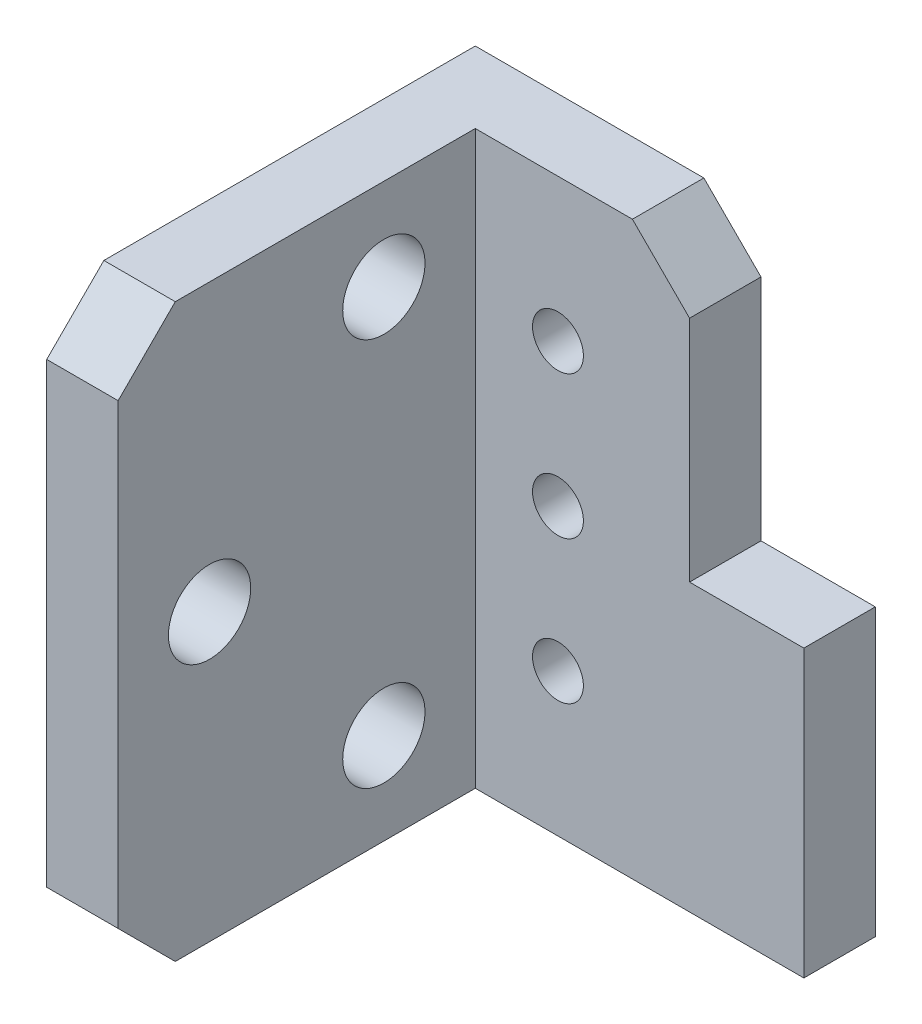
ISO-10303-21;
HEADER;
FILE_DESCRIPTION(('STEP AP214'),'2;1');
FILE_NAME('part.step','',(''),(''),'','','');
FILE_SCHEMA(('AUTOMOTIVE_DESIGN { 1 0 10303 214 1 1 1 1 }'));
ENDSEC;
DATA;
#1=APPLICATION_CONTEXT('core data for automotive mechanical design processes');
#2=APPLICATION_PROTOCOL_DEFINITION('international standard','automotive_design',2000,#1);
#3=PRODUCT_CONTEXT('',#1,'mechanical');
#4=PRODUCT('Part','Part','',(#3));
#5=PRODUCT_RELATED_PRODUCT_CATEGORY('part','',(#4));
#6=PRODUCT_DEFINITION_FORMATION('','',#4);
#7=PRODUCT_DEFINITION_CONTEXT('part definition',#1,'design');
#8=PRODUCT_DEFINITION('design','',#6,#7);
#9=PRODUCT_DEFINITION_SHAPE('','',#8);
#10=(LENGTH_UNIT() NAMED_UNIT(*) SI_UNIT(.MILLI.,.METRE.));
#11=(NAMED_UNIT(*) PLANE_ANGLE_UNIT() SI_UNIT($,.RADIAN.));
#12=(NAMED_UNIT(*) SI_UNIT($,.STERADIAN.) SOLID_ANGLE_UNIT());
#13=UNCERTAINTY_MEASURE_WITH_UNIT(LENGTH_MEASURE(1.E-05),#10,'distance_accuracy_value','');
#14=(GEOMETRIC_REPRESENTATION_CONTEXT(3) GLOBAL_UNCERTAINTY_ASSIGNED_CONTEXT((#13)) GLOBAL_UNIT_ASSIGNED_CONTEXT((#10,
#11,#12)) REPRESENTATION_CONTEXT('',''));
#15=CARTESIAN_POINT('',(0.,0.,0.));
#16=DIRECTION('',(0.,0.,1.));
#17=DIRECTION('',(1.,0.,0.));
#18=AXIS2_PLACEMENT_3D('',#15,#16,#17);
#19=CARTESIAN_POINT('',(0.,25.4,0.));
#20=DIRECTION('',(1.,0.,0.));
#21=DIRECTION('',(0.,0.,-1.));
#22=AXIS2_PLACEMENT_3D('',#19,#20,#21);
#23=PLANE('',#22);
#24=CARTESIAN_POINT('',(0.,4.064,7.239));
#25=DIRECTION('',(-1.,0.,0.));
#26=DIRECTION('',(0.,0.,1.));
#27=AXIS2_PLACEMENT_3D('',#24,#25,#26);
#28=CIRCLE('',#27,1.8288);
#29=CARTESIAN_POINT('',(0.,4.064,9.0678));
#30=VERTEX_POINT('',#29);
#31=EDGE_CURVE('E170',#30,#30,#28,.T.);
#32=ORIENTED_EDGE('',*,*,#31,.F.);
#33=EDGE_LOOP('',(#32));
#34=FACE_BOUND('',#33,.T.);
#35=CARTESIAN_POINT('',(0.,21.336,7.239));
#36=DIRECTION('',(-1.,0.,0.));
#37=DIRECTION('',(0.,0.,1.));
#38=AXIS2_PLACEMENT_3D('',#35,#36,#37);
#39=CIRCLE('',#38,1.8288);
#40=CARTESIAN_POINT('',(0.,21.336,9.0678));
#41=VERTEX_POINT('',#40);
#42=EDGE_CURVE('E174',#41,#41,#39,.T.);
#43=ORIENTED_EDGE('',*,*,#42,.F.);
#44=EDGE_LOOP('',(#43));
#45=FACE_BOUND('',#44,.T.);
#46=CARTESIAN_POINT('',(0.,12.7,14.986));
#47=DIRECTION('',(-1.,0.,0.));
#48=DIRECTION('',(0.,0.,1.));
#49=AXIS2_PLACEMENT_3D('',#46,#47,#48);
#50=CIRCLE('',#49,1.8288);
#51=CARTESIAN_POINT('',(0.,12.7,16.8148));
#52=VERTEX_POINT('',#51);
#53=EDGE_CURVE('E178',#52,#52,#50,.T.);
#54=ORIENTED_EDGE('',*,*,#53,.F.);
#55=EDGE_LOOP('',(#54));
#56=FACE_BOUND('',#55,.T.);
#57=DIRECTION('',(0.,0.,1.));
#58=VECTOR('',#57,1.);
#59=CARTESIAN_POINT('',(0.,0.,0.));
#60=LINE('',#59,#58);
#61=CARTESIAN_POINT('',(0.,0.,0.));
#62=VERTEX_POINT('',#61);
#63=CARTESIAN_POINT('',(0.,0.,16.51));
#64=VERTEX_POINT('',#63);
#65=EDGE_CURVE('E124',#62,#64,#60,.T.);
#66=ORIENTED_EDGE('',*,*,#65,.T.);
#67=DIRECTION('',(0.,-0.707106781186546,-0.707106781186549));
#68=VECTOR('',#67,1.);
#69=CARTESIAN_POINT('',(0.,2.54,19.05));
#70=LINE('',#69,#68);
#71=CARTESIAN_POINT('',(0.,2.54,19.05));
#72=VERTEX_POINT('',#71);
#73=EDGE_CURVE('E11',#64,#72,#70,.F.);
#74=ORIENTED_EDGE('',*,*,#73,.T.);
#75=DIRECTION('',(0.,-1.,0.));
#76=VECTOR('',#75,1.);
#77=CARTESIAN_POINT('',(0.,25.4,19.05));
#78=LINE('',#77,#76);
#79=CARTESIAN_POINT('',(0.,22.86,19.05));
#80=VERTEX_POINT('',#79);
#81=EDGE_CURVE('E210',#80,#72,#78,.T.);
#82=ORIENTED_EDGE('',*,*,#81,.F.);
#83=DIRECTION('',(0.,0.707106781186549,-0.707106781186546));
#84=VECTOR('',#83,1.);
#85=CARTESIAN_POINT('',(0.,25.4,16.51));
#86=LINE('',#85,#84);
#87=CARTESIAN_POINT('',(0.,25.4,16.51));
#88=VERTEX_POINT('',#87);
#89=EDGE_CURVE('E44',#80,#88,#86,.T.);
#90=ORIENTED_EDGE('',*,*,#89,.T.);
#91=DIRECTION('',(0.,0.,1.));
#92=VECTOR('',#91,1.);
#93=CARTESIAN_POINT('',(0.,25.4,0.));
#94=LINE('',#93,#92);
#95=CARTESIAN_POINT('',(0.,25.4,0.));
#96=VERTEX_POINT('',#95);
#97=EDGE_CURVE('E129',#96,#88,#94,.T.);
#98=ORIENTED_EDGE('',*,*,#97,.F.);
#99=DIRECTION('',(0.,-1.,0.));
#100=VECTOR('',#99,1.);
#101=CARTESIAN_POINT('',(0.,25.4,0.));
#102=LINE('',#101,#100);
#103=EDGE_CURVE('E193',#96,#62,#102,.T.);
#104=ORIENTED_EDGE('',*,*,#103,.T.);
#105=EDGE_LOOP('',(#66,#74,#82,#90,#98,#104));
#106=FACE_BOUND('',#105,.T.);
#107=ADVANCED_FACE('F35',(#34,#45,#56,#106),#23,.F.);
#108=CARTESIAN_POINT('',(0.,25.4,19.05));
#109=DIRECTION('',(0.,0.,-1.));
#110=DIRECTION('',(-1.,0.,0.));
#111=AXIS2_PLACEMENT_3D('',#108,#109,#110);
#112=PLANE('',#111);
#113=ORIENTED_EDGE('',*,*,#81,.T.);
#114=DIRECTION('',(1.,0.,0.));
#115=VECTOR('',#114,1.);
#116=CARTESIAN_POINT('',(0.,2.54,19.05));
#117=LINE('',#116,#115);
#118=CARTESIAN_POINT('',(3.175,2.54,19.05));
#119=VERTEX_POINT('',#118);
#120=EDGE_CURVE('E231',#72,#119,#117,.T.);
#121=ORIENTED_EDGE('',*,*,#120,.T.);
#122=DIRECTION('',(0.,-1.,0.));
#123=VECTOR('',#122,1.);
#124=CARTESIAN_POINT('',(3.175,25.4,19.05));
#125=LINE('',#124,#123);
#126=CARTESIAN_POINT('',(3.175,22.86,19.05));
#127=VERTEX_POINT('',#126);
#128=EDGE_CURVE('E207',#127,#119,#125,.T.);
#129=ORIENTED_EDGE('',*,*,#128,.F.);
#130=DIRECTION('',(-1.,0.,0.));
#131=VECTOR('',#130,1.);
#132=CARTESIAN_POINT('',(0.,22.86,19.05));
#133=LINE('',#132,#131);
#134=EDGE_CURVE('E56',#127,#80,#133,.T.);
#135=ORIENTED_EDGE('',*,*,#134,.T.);
#136=EDGE_LOOP('',(#113,#121,#129,#135));
#137=FACE_BOUND('',#136,.T.);
#138=ADVANCED_FACE('F249',(#137),#112,.F.);
#139=CARTESIAN_POINT('',(3.175,25.4,19.05));
#140=DIRECTION('',(-1.,0.,0.));
#141=DIRECTION('',(0.,0.,1.));
#142=AXIS2_PLACEMENT_3D('',#139,#140,#141);
#143=PLANE('',#142);
#144=CARTESIAN_POINT('',(3.175,4.064,7.239));
#145=DIRECTION('',(-1.,0.,0.));
#146=DIRECTION('',(0.,0.,1.));
#147=AXIS2_PLACEMENT_3D('',#144,#145,#146);
#148=CIRCLE('',#147,1.8288);
#149=CARTESIAN_POINT('',(3.175,4.064,9.0678));
#150=VERTEX_POINT('',#149);
#151=EDGE_CURVE('E173',#150,#150,#148,.T.);
#152=ORIENTED_EDGE('',*,*,#151,.T.);
#153=EDGE_LOOP('',(#152));
#154=FACE_BOUND('',#153,.T.);
#155=CARTESIAN_POINT('',(3.175,21.336,7.239));
#156=DIRECTION('',(-1.,0.,0.));
#157=DIRECTION('',(0.,0.,1.));
#158=AXIS2_PLACEMENT_3D('',#155,#156,#157);
#159=CIRCLE('',#158,1.8288);
#160=CARTESIAN_POINT('',(3.175,21.336,9.0678));
#161=VERTEX_POINT('',#160);
#162=EDGE_CURVE('E177',#161,#161,#159,.T.);
#163=ORIENTED_EDGE('',*,*,#162,.T.);
#164=EDGE_LOOP('',(#163));
#165=FACE_BOUND('',#164,.T.);
#166=CARTESIAN_POINT('',(3.175,12.7,14.986));
#167=DIRECTION('',(-1.,0.,0.));
#168=DIRECTION('',(0.,0.,1.));
#169=AXIS2_PLACEMENT_3D('',#166,#167,#168);
#170=CIRCLE('',#169,1.8288);
#171=CARTESIAN_POINT('',(3.175,12.7,16.8148));
#172=VERTEX_POINT('',#171);
#173=EDGE_CURVE('E181',#172,#172,#170,.T.);
#174=ORIENTED_EDGE('',*,*,#173,.T.);
#175=EDGE_LOOP('',(#174));
#176=FACE_BOUND('',#175,.T.);
#177=ORIENTED_EDGE('',*,*,#128,.T.);
#178=DIRECTION('',(0.,0.707106781186546,0.707106781186549));
#179=VECTOR('',#178,1.);
#180=CARTESIAN_POINT('',(3.175,2.54,19.05));
#181=LINE('',#180,#179);
#182=CARTESIAN_POINT('',(3.175,0.,16.51));
#183=VERTEX_POINT('',#182);
#184=EDGE_CURVE('E236',#119,#183,#181,.F.);
#185=ORIENTED_EDGE('',*,*,#184,.T.);
#186=DIRECTION('',(0.,0.,-1.));
#187=VECTOR('',#186,1.);
#188=CARTESIAN_POINT('',(3.175,0.,19.05));
#189=LINE('',#188,#187);
#190=CARTESIAN_POINT('',(3.175,0.,3.175));
#191=VERTEX_POINT('',#190);
#192=EDGE_CURVE('E195',#183,#191,#189,.T.);
#193=ORIENTED_EDGE('',*,*,#192,.T.);
#194=DIRECTION('',(0.,-1.,0.));
#195=VECTOR('',#194,1.);
#196=CARTESIAN_POINT('',(3.175,25.4,3.175));
#197=LINE('',#196,#195);
#198=CARTESIAN_POINT('',(3.175,25.4,3.175));
#199=VERTEX_POINT('',#198);
#200=EDGE_CURVE('E204',#199,#191,#197,.T.);
#201=ORIENTED_EDGE('',*,*,#200,.F.);
#202=DIRECTION('',(0.,0.,-1.));
#203=VECTOR('',#202,1.);
#204=CARTESIAN_POINT('',(3.175,25.4,19.05));
#205=LINE('',#204,#203);
#206=CARTESIAN_POINT('',(3.175,25.4,16.51));
#207=VERTEX_POINT('',#206);
#208=EDGE_CURVE('E186',#207,#199,#205,.T.);
#209=ORIENTED_EDGE('',*,*,#208,.F.);
#210=DIRECTION('',(0.,-0.707106781186549,0.707106781186546));
#211=VECTOR('',#210,1.);
#212=CARTESIAN_POINT('',(3.175,25.4,16.51));
#213=LINE('',#212,#211);
#214=EDGE_CURVE('E234',#207,#127,#213,.T.);
#215=ORIENTED_EDGE('',*,*,#214,.T.);
#216=EDGE_LOOP('',(#177,#185,#193,#201,#209,#215));
#217=FACE_BOUND('',#216,.T.);
#218=ADVANCED_FACE('F247',(#154,#165,#176,#217),#143,.F.);
#219=CARTESIAN_POINT('',(12.7,25.4,3.175));
#220=DIRECTION('',(0.,0.,-1.));
#221=DIRECTION('',(-1.,0.,0.));
#222=AXIS2_PLACEMENT_3D('',#219,#220,#221);
#223=PLANE('',#222);
#224=DIRECTION('',(-1.,0.,0.));
#225=VECTOR('',#224,1.);
#226=CARTESIAN_POINT('',(17.78,12.7,3.175));
#227=LINE('',#226,#225);
#228=CARTESIAN_POINT('',(17.78,12.7,3.175));
#229=VERTEX_POINT('',#228);
#230=CARTESIAN_POINT('',(12.7,12.7,3.175));
#231=VERTEX_POINT('',#230);
#232=EDGE_CURVE('E150',#229,#231,#227,.T.);
#233=ORIENTED_EDGE('',*,*,#232,.T.);
#234=DIRECTION('',(0.,-1.,0.));
#235=VECTOR('',#234,1.);
#236=CARTESIAN_POINT('',(12.7,25.4,3.175));
#237=LINE('',#236,#235);
#238=CARTESIAN_POINT('',(12.7,22.86,3.175));
#239=VERTEX_POINT('',#238);
#240=EDGE_CURVE('E201',#239,#231,#237,.T.);
#241=ORIENTED_EDGE('',*,*,#240,.F.);
#242=DIRECTION('',(-0.707106781186547,0.707106781186548,0.));
#243=VECTOR('',#242,1.);
#244=CARTESIAN_POINT('',(10.16,25.4,3.175));
#245=LINE('',#244,#243);
#246=CARTESIAN_POINT('',(10.16,25.4,3.175));
#247=VERTEX_POINT('',#246);
#248=EDGE_CURVE('E222',#239,#247,#245,.T.);
#249=ORIENTED_EDGE('',*,*,#248,.T.);
#250=DIRECTION('',(1.,0.,0.));
#251=VECTOR('',#250,1.);
#252=CARTESIAN_POINT('',(12.7,25.4,3.175));
#253=LINE('',#252,#251);
#254=EDGE_CURVE('E188',#199,#247,#253,.T.);
#255=ORIENTED_EDGE('',*,*,#254,.F.);
#256=ORIENTED_EDGE('',*,*,#200,.T.);
#257=DIRECTION('',(1.,0.,0.));
#258=VECTOR('',#257,1.);
#259=CARTESIAN_POINT('',(12.7,0.,3.175));
#260=LINE('',#259,#258);
#261=CARTESIAN_POINT('',(17.78,0.,3.175));
#262=VERTEX_POINT('',#261);
#263=EDGE_CURVE('E130',#191,#262,#260,.T.);
#264=ORIENTED_EDGE('',*,*,#263,.T.);
#265=DIRECTION('',(0.,1.,0.));
#266=VECTOR('',#265,1.);
#267=CARTESIAN_POINT('',(17.78,12.7,3.175));
#268=LINE('',#267,#266);
#269=EDGE_CURVE('E138',#262,#229,#268,.T.);
#270=ORIENTED_EDGE('',*,*,#269,.T.);
#271=EDGE_LOOP('',(#233,#241,#249,#255,#256,#264,#270));
#272=FACE_BOUND('',#271,.T.);
#273=CARTESIAN_POINT('',(6.84999439999996,6.35,3.175));
#274=DIRECTION('',(0.,0.,-1.));
#275=DIRECTION('',(-1.,0.,0.));
#276=AXIS2_PLACEMENT_3D('',#273,#274,#275);
#277=CIRCLE('',#276,1.13029999999999);
#278=CARTESIAN_POINT('',(5.71969439999997,6.35,3.175));
#279=VERTEX_POINT('',#278);
#280=EDGE_CURVE('E158',#279,#279,#277,.T.);
#281=ORIENTED_EDGE('',*,*,#280,.T.);
#282=EDGE_LOOP('',(#281));
#283=FACE_BOUND('',#282,.T.);
#284=CARTESIAN_POINT('',(6.84999439999996,12.7,3.175));
#285=DIRECTION('',(0.,0.,-1.));
#286=DIRECTION('',(-1.,0.,0.));
#287=AXIS2_PLACEMENT_3D('',#284,#285,#286);
#288=CIRCLE('',#287,1.13029999999999);
#289=CARTESIAN_POINT('',(5.71969439999997,12.7,3.175));
#290=VERTEX_POINT('',#289);
#291=EDGE_CURVE('E39',#290,#290,#288,.T.);
#292=ORIENTED_EDGE('',*,*,#291,.T.);
#293=EDGE_LOOP('',(#292));
#294=FACE_BOUND('',#293,.T.);
#295=CARTESIAN_POINT('',(6.84999439999996,19.05,3.175));
#296=DIRECTION('',(0.,0.,-1.));
#297=DIRECTION('',(-1.,0.,0.));
#298=AXIS2_PLACEMENT_3D('',#295,#296,#297);
#299=CIRCLE('',#298,1.13029999999999);
#300=CARTESIAN_POINT('',(5.71969439999997,19.05,3.175));
#301=VERTEX_POINT('',#300);
#302=EDGE_CURVE('E167',#301,#301,#299,.T.);
#303=ORIENTED_EDGE('',*,*,#302,.T.);
#304=EDGE_LOOP('',(#303));
#305=FACE_BOUND('',#304,.T.);
#306=ADVANCED_FACE('F257',(#272,#283,#294,#305),#223,.F.);
#307=CARTESIAN_POINT('',(12.7,25.4,0.));
#308=DIRECTION('',(-1.,0.,0.));
#309=DIRECTION('',(0.,0.,1.));
#310=AXIS2_PLACEMENT_3D('',#307,#308,#309);
#311=PLANE('',#310);
#312=ORIENTED_EDGE('',*,*,#240,.T.);
#313=DIRECTION('',(0.,0.,-1.));
#314=VECTOR('',#313,1.);
#315=CARTESIAN_POINT('',(12.7,12.7,0.));
#316=LINE('',#315,#314);
#317=CARTESIAN_POINT('',(12.7,12.7,0.));
#318=VERTEX_POINT('',#317);
#319=EDGE_CURVE('E152',#231,#318,#316,.T.);
#320=ORIENTED_EDGE('',*,*,#319,.T.);
#321=DIRECTION('',(0.,-1.,0.));
#322=VECTOR('',#321,1.);
#323=CARTESIAN_POINT('',(12.7,25.4,0.));
#324=LINE('',#323,#322);
#325=CARTESIAN_POINT('',(12.7,22.86,0.));
#326=VERTEX_POINT('',#325);
#327=EDGE_CURVE('E199',#326,#318,#324,.T.);
#328=ORIENTED_EDGE('',*,*,#327,.F.);
#329=DIRECTION('',(0.,0.,1.));
#330=VECTOR('',#329,1.);
#331=CARTESIAN_POINT('',(12.7,22.86,3.175));
#332=LINE('',#331,#330);
#333=EDGE_CURVE('E212',#326,#239,#332,.T.);
#334=ORIENTED_EDGE('',*,*,#333,.T.);
#335=EDGE_LOOP('',(#312,#320,#328,#334));
#336=FACE_BOUND('',#335,.T.);
#337=ADVANCED_FACE('F269',(#336),#311,.F.);
#338=CARTESIAN_POINT('',(0.,25.4,0.));
#339=DIRECTION('',(0.,0.,1.));
#340=DIRECTION('',(1.,0.,0.));
#341=AXIS2_PLACEMENT_3D('',#338,#339,#340);
#342=PLANE('',#341);
#343=CARTESIAN_POINT('',(6.84999439999996,6.35,0.));
#344=DIRECTION('',(0.,0.,-1.));
#345=DIRECTION('',(-1.,0.,0.));
#346=AXIS2_PLACEMENT_3D('',#343,#344,#345);
#347=CIRCLE('',#346,1.13029999999999);
#348=CARTESIAN_POINT('',(5.71969439999997,6.35,0.));
#349=VERTEX_POINT('',#348);
#350=EDGE_CURVE('E155',#349,#349,#347,.T.);
#351=ORIENTED_EDGE('',*,*,#350,.F.);
#352=EDGE_LOOP('',(#351));
#353=FACE_BOUND('',#352,.T.);
#354=CARTESIAN_POINT('',(6.84999439999996,12.7,0.));
#355=DIRECTION('',(0.,0.,-1.));
#356=DIRECTION('',(-1.,0.,0.));
#357=AXIS2_PLACEMENT_3D('',#354,#355,#356);
#358=CIRCLE('',#357,1.13029999999999);
#359=CARTESIAN_POINT('',(5.71969439999997,12.7,0.));
#360=VERTEX_POINT('',#359);
#361=EDGE_CURVE('E161',#360,#360,#358,.T.);
#362=ORIENTED_EDGE('',*,*,#361,.F.);
#363=EDGE_LOOP('',(#362));
#364=FACE_BOUND('',#363,.T.);
#365=CARTESIAN_POINT('',(6.84999439999996,19.05,0.));
#366=DIRECTION('',(0.,0.,-1.));
#367=DIRECTION('',(-1.,0.,0.));
#368=AXIS2_PLACEMENT_3D('',#365,#366,#367);
#369=CIRCLE('',#368,1.13029999999999);
#370=CARTESIAN_POINT('',(5.71969439999997,19.05,0.));
#371=VERTEX_POINT('',#370);
#372=EDGE_CURVE('E164',#371,#371,#369,.T.);
#373=ORIENTED_EDGE('',*,*,#372,.F.);
#374=EDGE_LOOP('',(#373));
#375=FACE_BOUND('',#374,.T.);
#376=ORIENTED_EDGE('',*,*,#327,.T.);
#377=DIRECTION('',(1.,0.,0.));
#378=VECTOR('',#377,1.);
#379=CARTESIAN_POINT('',(17.78,12.7,0.));
#380=LINE('',#379,#378);
#381=CARTESIAN_POINT('',(17.78,12.7,0.));
#382=VERTEX_POINT('',#381);
#383=EDGE_CURVE('E140',#318,#382,#380,.T.);
#384=ORIENTED_EDGE('',*,*,#383,.T.);
#385=DIRECTION('',(0.,-1.,0.));
#386=VECTOR('',#385,1.);
#387=CARTESIAN_POINT('',(17.78,12.7,0.));
#388=LINE('',#387,#386);
#389=CARTESIAN_POINT('',(17.78,0.,0.));
#390=VERTEX_POINT('',#389);
#391=EDGE_CURVE('E137',#382,#390,#388,.T.);
#392=ORIENTED_EDGE('',*,*,#391,.T.);
#393=DIRECTION('',(-1.,0.,0.));
#394=VECTOR('',#393,1.);
#395=CARTESIAN_POINT('',(0.,0.,0.));
#396=LINE('',#395,#394);
#397=EDGE_CURVE('E119',#390,#62,#396,.T.);
#398=ORIENTED_EDGE('',*,*,#397,.T.);
#399=ORIENTED_EDGE('',*,*,#103,.F.);
#400=DIRECTION('',(-1.,0.,0.));
#401=VECTOR('',#400,1.);
#402=CARTESIAN_POINT('',(0.,25.4,0.));
#403=LINE('',#402,#401);
#404=CARTESIAN_POINT('',(10.16,25.4,0.));
#405=VERTEX_POINT('',#404);
#406=EDGE_CURVE('E191',#405,#96,#403,.T.);
#407=ORIENTED_EDGE('',*,*,#406,.F.);
#408=DIRECTION('',(0.707106781186547,-0.707106781186548,0.));
#409=VECTOR('',#408,1.);
#410=CARTESIAN_POINT('',(10.16,25.4,0.));
#411=LINE('',#410,#409);
#412=EDGE_CURVE('E218',#405,#326,#411,.T.);
#413=ORIENTED_EDGE('',*,*,#412,.T.);
#414=EDGE_LOOP('',(#376,#384,#392,#398,#399,#407,#413));
#415=FACE_BOUND('',#414,.T.);
#416=ADVANCED_FACE('F143',(#353,#364,#375,#415),#342,.F.);
#417=CARTESIAN_POINT('',(0.,25.4,0.));
#418=DIRECTION('',(0.,1.,0.));
#419=DIRECTION('',(0.,0.,1.));
#420=AXIS2_PLACEMENT_3D('',#417,#418,#419);
#421=PLANE('',#420);
#422=ORIENTED_EDGE('',*,*,#254,.T.);
#423=DIRECTION('',(0.,0.,-1.));
#424=VECTOR('',#423,1.);
#425=CARTESIAN_POINT('',(10.16,25.4,0.));
#426=LINE('',#425,#424);
#427=EDGE_CURVE('E227',#247,#405,#426,.T.);
#428=ORIENTED_EDGE('',*,*,#427,.T.);
#429=ORIENTED_EDGE('',*,*,#406,.T.);
#430=ORIENTED_EDGE('',*,*,#97,.T.);
#431=DIRECTION('',(1.,0.,0.));
#432=VECTOR('',#431,1.);
#433=CARTESIAN_POINT('',(3.175,25.4,16.51));
#434=LINE('',#433,#432);
#435=EDGE_CURVE('E224',#88,#207,#434,.T.);
#436=ORIENTED_EDGE('',*,*,#435,.T.);
#437=ORIENTED_EDGE('',*,*,#208,.T.);
#438=EDGE_LOOP('',(#422,#428,#429,#430,#436,#437));
#439=FACE_BOUND('',#438,.T.);
#440=ADVANCED_FACE('F243',(#439),#421,.T.);
#441=CARTESIAN_POINT('',(0.,0.,0.));
#442=DIRECTION('',(0.,1.,0.));
#443=DIRECTION('',(0.,0.,1.));
#444=AXIS2_PLACEMENT_3D('',#441,#442,#443);
#445=PLANE('',#444);
#446=ORIENTED_EDGE('',*,*,#397,.F.);
#447=DIRECTION('',(0.,0.,-1.));
#448=VECTOR('',#447,1.);
#449=CARTESIAN_POINT('',(17.78,0.,17.9856178129071));
#450=LINE('',#449,#448);
#451=EDGE_CURVE('E123',#262,#390,#450,.T.);
#452=ORIENTED_EDGE('',*,*,#451,.F.);
#453=ORIENTED_EDGE('',*,*,#263,.F.);
#454=ORIENTED_EDGE('',*,*,#192,.F.);
#455=DIRECTION('',(-1.,0.,0.));
#456=VECTOR('',#455,1.);
#457=CARTESIAN_POINT('',(0.,0.,16.51));
#458=LINE('',#457,#456);
#459=EDGE_CURVE('E220',#183,#64,#458,.T.);
#460=ORIENTED_EDGE('',*,*,#459,.T.);
#461=ORIENTED_EDGE('',*,*,#65,.F.);
#462=EDGE_LOOP('',(#446,#452,#453,#454,#460,#461));
#463=FACE_BOUND('',#462,.T.);
#464=ADVANCED_FACE('F121',(#463),#445,.F.);
#465=CARTESIAN_POINT('',(0.,12.7,14.986));
#466=DIRECTION('',(-1.,0.,0.));
#467=DIRECTION('',(0.,0.,1.));
#468=AXIS2_PLACEMENT_3D('',#465,#466,#467);
#469=CYLINDRICAL_SURFACE('',#468,1.8288);
#470=ORIENTED_EDGE('',*,*,#53,.T.);
#471=EDGE_LOOP('',(#470));
#472=FACE_BOUND('',#471,.T.);
#473=ORIENTED_EDGE('',*,*,#173,.F.);
#474=EDGE_LOOP('',(#473));
#475=FACE_BOUND('',#474,.T.);
#476=ADVANCED_FACE('F319',(#472,#475),#469,.F.);
#477=CARTESIAN_POINT('',(0.,21.336,7.239));
#478=DIRECTION('',(-1.,0.,0.));
#479=DIRECTION('',(0.,0.,1.));
#480=AXIS2_PLACEMENT_3D('',#477,#478,#479);
#481=CYLINDRICAL_SURFACE('',#480,1.8288);
#482=ORIENTED_EDGE('',*,*,#42,.T.);
#483=EDGE_LOOP('',(#482));
#484=FACE_BOUND('',#483,.T.);
#485=ORIENTED_EDGE('',*,*,#162,.F.);
#486=EDGE_LOOP('',(#485));
#487=FACE_BOUND('',#486,.T.);
#488=ADVANCED_FACE('F315',(#484,#487),#481,.F.);
#489=CARTESIAN_POINT('',(0.,4.064,7.239));
#490=DIRECTION('',(-1.,0.,0.));
#491=DIRECTION('',(0.,0.,1.));
#492=AXIS2_PLACEMENT_3D('',#489,#490,#491);
#493=CYLINDRICAL_SURFACE('',#492,1.8288);
#494=ORIENTED_EDGE('',*,*,#31,.T.);
#495=EDGE_LOOP('',(#494));
#496=FACE_BOUND('',#495,.T.);
#497=ORIENTED_EDGE('',*,*,#151,.F.);
#498=EDGE_LOOP('',(#497));
#499=FACE_BOUND('',#498,.T.);
#500=ADVANCED_FACE('F295',(#496,#499),#493,.F.);
#501=CARTESIAN_POINT('',(10.16,25.4,0.));
#502=DIRECTION('',(0.707106781186548,0.707106781186547,0.));
#503=DIRECTION('',(0.,0.,1.));
#504=AXIS2_PLACEMENT_3D('',#501,#502,#503);
#505=PLANE('',#504);
#506=ORIENTED_EDGE('',*,*,#248,.F.);
#507=ORIENTED_EDGE('',*,*,#333,.F.);
#508=ORIENTED_EDGE('',*,*,#412,.F.);
#509=ORIENTED_EDGE('',*,*,#427,.F.);
#510=EDGE_LOOP('',(#506,#507,#508,#509));
#511=FACE_BOUND('',#510,.T.);
#512=ADVANCED_FACE('F265',(#511),#505,.T.);
#513=CARTESIAN_POINT('',(0.,2.54,19.05));
#514=DIRECTION('',(0.,0.707106781186549,-0.707106781186546));
#515=DIRECTION('',(1.,0.,0.));
#516=AXIS2_PLACEMENT_3D('',#513,#514,#515);
#517=PLANE('',#516);
#518=ORIENTED_EDGE('',*,*,#73,.F.);
#519=ORIENTED_EDGE('',*,*,#459,.F.);
#520=ORIENTED_EDGE('',*,*,#184,.F.);
#521=ORIENTED_EDGE('',*,*,#120,.F.);
#522=EDGE_LOOP('',(#518,#519,#520,#521));
#523=FACE_BOUND('',#522,.T.);
#524=ADVANCED_FACE('F252',(#523),#517,.F.);
#525=CARTESIAN_POINT('',(0.,25.4,16.51));
#526=DIRECTION('',(0.,0.707106781186546,0.707106781186549));
#527=DIRECTION('',(-1.,0.,0.));
#528=AXIS2_PLACEMENT_3D('',#525,#526,#527);
#529=PLANE('',#528);
#530=ORIENTED_EDGE('',*,*,#89,.F.);
#531=ORIENTED_EDGE('',*,*,#134,.F.);
#532=ORIENTED_EDGE('',*,*,#214,.F.);
#533=ORIENTED_EDGE('',*,*,#435,.F.);
#534=EDGE_LOOP('',(#530,#531,#532,#533));
#535=FACE_BOUND('',#534,.T.);
#536=ADVANCED_FACE('F37',(#535),#529,.T.);
#537=CARTESIAN_POINT('',(6.84999439999996,19.05,0.));
#538=DIRECTION('',(0.,0.,-1.));
#539=DIRECTION('',(-1.,0.,0.));
#540=AXIS2_PLACEMENT_3D('',#537,#538,#539);
#541=CYLINDRICAL_SURFACE('',#540,1.13029999999999);
#542=ORIENTED_EDGE('',*,*,#372,.T.);
#543=EDGE_LOOP('',(#542));
#544=FACE_BOUND('',#543,.T.);
#545=ORIENTED_EDGE('',*,*,#302,.F.);
#546=EDGE_LOOP('',(#545));
#547=FACE_BOUND('',#546,.T.);
#548=ADVANCED_FACE('F300',(#544,#547),#541,.F.);
#549=CARTESIAN_POINT('',(6.84999439999996,12.7,0.));
#550=DIRECTION('',(0.,0.,-1.));
#551=DIRECTION('',(-1.,0.,0.));
#552=AXIS2_PLACEMENT_3D('',#549,#550,#551);
#553=CYLINDRICAL_SURFACE('',#552,1.13029999999999);
#554=ORIENTED_EDGE('',*,*,#361,.T.);
#555=EDGE_LOOP('',(#554));
#556=FACE_BOUND('',#555,.T.);
#557=ORIENTED_EDGE('',*,*,#291,.F.);
#558=EDGE_LOOP('',(#557));
#559=FACE_BOUND('',#558,.T.);
#560=ADVANCED_FACE('F280',(#556,#559),#553,.F.);
#561=CARTESIAN_POINT('',(6.84999439999996,6.35,0.));
#562=DIRECTION('',(0.,0.,-1.));
#563=DIRECTION('',(-1.,0.,0.));
#564=AXIS2_PLACEMENT_3D('',#561,#562,#563);
#565=CYLINDRICAL_SURFACE('',#564,1.13029999999999);
#566=ORIENTED_EDGE('',*,*,#350,.T.);
#567=EDGE_LOOP('',(#566));
#568=FACE_BOUND('',#567,.T.);
#569=ORIENTED_EDGE('',*,*,#280,.F.);
#570=EDGE_LOOP('',(#569));
#571=FACE_BOUND('',#570,.T.);
#572=ADVANCED_FACE('F273',(#568,#571),#565,.F.);
#573=CARTESIAN_POINT('',(17.78,12.7,17.9856178129071));
#574=DIRECTION('',(0.,1.,0.));
#575=DIRECTION('',(0.,0.,1.));
#576=AXIS2_PLACEMENT_3D('',#573,#574,#575);
#577=PLANE('',#576);
#578=ORIENTED_EDGE('',*,*,#319,.F.);
#579=ORIENTED_EDGE('',*,*,#232,.F.);
#580=DIRECTION('',(0.,0.,-1.));
#581=VECTOR('',#580,1.);
#582=CARTESIAN_POINT('',(17.78,12.7,17.9856178129071));
#583=LINE('',#582,#581);
#584=EDGE_CURVE('E139',#229,#382,#583,.T.);
#585=ORIENTED_EDGE('',*,*,#584,.T.);
#586=ORIENTED_EDGE('',*,*,#383,.F.);
#587=EDGE_LOOP('',(#578,#579,#585,#586));
#588=FACE_BOUND('',#587,.T.);
#589=ADVANCED_FACE('F271',(#588),#577,.T.);
#590=CARTESIAN_POINT('',(17.78,12.7,17.9856178129071));
#591=DIRECTION('',(1.,0.,0.));
#592=DIRECTION('',(0.,0.,-1.));
#593=AXIS2_PLACEMENT_3D('',#590,#591,#592);
#594=PLANE('',#593);
#595=ORIENTED_EDGE('',*,*,#269,.F.);
#596=ORIENTED_EDGE('',*,*,#451,.T.);
#597=ORIENTED_EDGE('',*,*,#391,.F.);
#598=ORIENTED_EDGE('',*,*,#584,.F.);
#599=EDGE_LOOP('',(#595,#596,#597,#598));
#600=FACE_BOUND('',#599,.T.);
#601=ADVANCED_FACE('F135',(#600),#594,.T.);
#602=CLOSED_SHELL('',(#107,#138,#218,#306,#337,#416,#440,#464,#476,#488,#500,#512,#524,#536,
#548,#560,#572,#589,#601));
#603=MANIFOLD_SOLID_BREP('B2',#602);
#604=ADVANCED_BREP_SHAPE_REPRESENTATION('',(#18,#603),#14);
#605=SHAPE_DEFINITION_REPRESENTATION(#9,#604);
ENDSEC;
END-ISO-10303-21;
